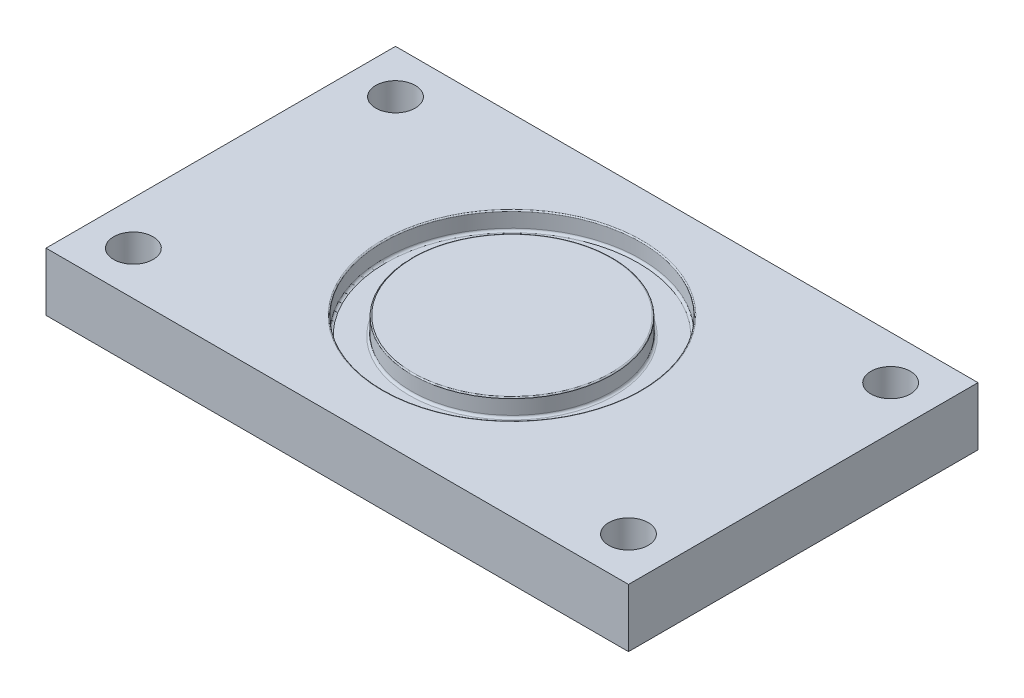
ISO-10303-21;
HEADER;
FILE_DESCRIPTION(('STEP AP214'),'2;1');
FILE_NAME('part.step','',(''),(''),'','','');
FILE_SCHEMA(('AUTOMOTIVE_DESIGN { 1 0 10303 214 1 1 1 1 }'));
ENDSEC;
DATA;
#1=APPLICATION_CONTEXT('core data for automotive mechanical design processes');
#2=APPLICATION_PROTOCOL_DEFINITION('international standard','automotive_design',2000,#1);
#3=PRODUCT_CONTEXT('',#1,'mechanical');
#4=PRODUCT('Part','Part','',(#3));
#5=PRODUCT_RELATED_PRODUCT_CATEGORY('part','',(#4));
#6=PRODUCT_DEFINITION_FORMATION('','',#4);
#7=PRODUCT_DEFINITION_CONTEXT('part definition',#1,'design');
#8=PRODUCT_DEFINITION('design','',#6,#7);
#9=PRODUCT_DEFINITION_SHAPE('','',#8);
#10=(LENGTH_UNIT() NAMED_UNIT(*) SI_UNIT(.MILLI.,.METRE.));
#11=(NAMED_UNIT(*) PLANE_ANGLE_UNIT() SI_UNIT($,.RADIAN.));
#12=(NAMED_UNIT(*) SI_UNIT($,.STERADIAN.) SOLID_ANGLE_UNIT());
#13=UNCERTAINTY_MEASURE_WITH_UNIT(LENGTH_MEASURE(1.E-05),#10,'distance_accuracy_value','');
#14=(GEOMETRIC_REPRESENTATION_CONTEXT(3) GLOBAL_UNCERTAINTY_ASSIGNED_CONTEXT((#13)) GLOBAL_UNIT_ASSIGNED_CONTEXT((#10,
#11,#12)) REPRESENTATION_CONTEXT('',''));
#15=CARTESIAN_POINT('',(0.,0.,0.));
#16=DIRECTION('',(0.,0.,1.));
#17=DIRECTION('',(1.,0.,0.));
#18=AXIS2_PLACEMENT_3D('',#15,#16,#17);
#19=CARTESIAN_POINT('',(-31.75,6.35,19.05));
#20=DIRECTION('',(1.,0.,0.));
#21=DIRECTION('',(0.,0.,-1.));
#22=AXIS2_PLACEMENT_3D('',#19,#20,#21);
#23=PLANE('',#22);
#24=DIRECTION('',(0.,0.,1.));
#25=VECTOR('',#24,1.);
#26=CARTESIAN_POINT('',(-31.75,0.,19.05));
#27=LINE('',#26,#25);
#28=CARTESIAN_POINT('',(-31.75,0.,-19.05));
#29=VERTEX_POINT('',#28);
#30=CARTESIAN_POINT('',(-31.75,0.,19.05));
#31=VERTEX_POINT('',#30);
#32=EDGE_CURVE('E104',#29,#31,#27,.T.);
#33=ORIENTED_EDGE('',*,*,#32,.T.);
#34=DIRECTION('',(0.,-1.,0.));
#35=VECTOR('',#34,1.);
#36=CARTESIAN_POINT('',(-31.75,6.35,19.05));
#37=LINE('',#36,#35);
#38=CARTESIAN_POINT('',(-31.75,6.35,19.05));
#39=VERTEX_POINT('',#38);
#40=EDGE_CURVE('E95',#39,#31,#37,.T.);
#41=ORIENTED_EDGE('',*,*,#40,.F.);
#42=DIRECTION('',(0.,0.,1.));
#43=VECTOR('',#42,1.);
#44=CARTESIAN_POINT('',(-31.75,6.35,19.05));
#45=LINE('',#44,#43);
#46=CARTESIAN_POINT('',(-31.75,6.35,-19.05));
#47=VERTEX_POINT('',#46);
#48=EDGE_CURVE('E89',#47,#39,#45,.T.);
#49=ORIENTED_EDGE('',*,*,#48,.F.);
#50=DIRECTION('',(0.,-1.,0.));
#51=VECTOR('',#50,1.);
#52=CARTESIAN_POINT('',(-31.75,6.35,-19.05));
#53=LINE('',#52,#51);
#54=EDGE_CURVE('E100',#47,#29,#53,.T.);
#55=ORIENTED_EDGE('',*,*,#54,.T.);
#56=EDGE_LOOP('',(#33,#41,#49,#55));
#57=FACE_BOUND('',#56,.T.);
#58=ADVANCED_FACE('F36',(#57),#23,.F.);
#59=CARTESIAN_POINT('',(31.75,6.35,19.05));
#60=DIRECTION('',(0.,0.,-1.));
#61=DIRECTION('',(-1.,0.,0.));
#62=AXIS2_PLACEMENT_3D('',#59,#60,#61);
#63=PLANE('',#62);
#64=DIRECTION('',(1.,0.,0.));
#65=VECTOR('',#64,1.);
#66=CARTESIAN_POINT('',(31.75,0.,19.05));
#67=LINE('',#66,#65);
#68=CARTESIAN_POINT('',(31.75,0.,19.05));
#69=VERTEX_POINT('',#68);
#70=EDGE_CURVE('E94',#31,#69,#67,.T.);
#71=ORIENTED_EDGE('',*,*,#70,.T.);
#72=DIRECTION('',(0.,-1.,0.));
#73=VECTOR('',#72,1.);
#74=CARTESIAN_POINT('',(31.75,6.35,19.05));
#75=LINE('',#74,#73);
#76=CARTESIAN_POINT('',(31.75,6.35,19.05));
#77=VERTEX_POINT('',#76);
#78=EDGE_CURVE('E92',#77,#69,#75,.T.);
#79=ORIENTED_EDGE('',*,*,#78,.F.);
#80=DIRECTION('',(1.,0.,0.));
#81=VECTOR('',#80,1.);
#82=CARTESIAN_POINT('',(31.75,6.35,19.05));
#83=LINE('',#82,#81);
#84=EDGE_CURVE('E84',#39,#77,#83,.T.);
#85=ORIENTED_EDGE('',*,*,#84,.F.);
#86=ORIENTED_EDGE('',*,*,#40,.T.);
#87=EDGE_LOOP('',(#71,#79,#85,#86));
#88=FACE_BOUND('',#87,.T.);
#89=ADVANCED_FACE('F93',(#88),#63,.F.);
#90=CARTESIAN_POINT('',(31.75,6.35,19.05));
#91=DIRECTION('',(-1.,0.,0.));
#92=DIRECTION('',(0.,0.,1.));
#93=AXIS2_PLACEMENT_3D('',#90,#91,#92);
#94=PLANE('',#93);
#95=DIRECTION('',(0.,0.,-1.));
#96=VECTOR('',#95,1.);
#97=CARTESIAN_POINT('',(31.75,0.,19.05));
#98=LINE('',#97,#96);
#99=CARTESIAN_POINT('',(31.75,0.,-19.05));
#100=VERTEX_POINT('',#99);
#101=EDGE_CURVE('E70',#69,#100,#98,.T.);
#102=ORIENTED_EDGE('',*,*,#101,.T.);
#103=DIRECTION('',(0.,-1.,0.));
#104=VECTOR('',#103,1.);
#105=CARTESIAN_POINT('',(31.75,6.35,-19.05));
#106=LINE('',#105,#104);
#107=CARTESIAN_POINT('',(31.75,6.35,-19.05));
#108=VERTEX_POINT('',#107);
#109=EDGE_CURVE('E96',#108,#100,#106,.T.);
#110=ORIENTED_EDGE('',*,*,#109,.F.);
#111=DIRECTION('',(0.,0.,-1.));
#112=VECTOR('',#111,1.);
#113=CARTESIAN_POINT('',(31.75,6.35,19.05));
#114=LINE('',#113,#112);
#115=EDGE_CURVE('E87',#77,#108,#114,.T.);
#116=ORIENTED_EDGE('',*,*,#115,.F.);
#117=ORIENTED_EDGE('',*,*,#78,.T.);
#118=EDGE_LOOP('',(#102,#110,#116,#117));
#119=FACE_BOUND('',#118,.T.);
#120=ADVANCED_FACE('F98',(#119),#94,.F.);
#121=CARTESIAN_POINT('',(31.75,6.35,-19.05));
#122=DIRECTION('',(0.,0.,1.));
#123=DIRECTION('',(1.,0.,0.));
#124=AXIS2_PLACEMENT_3D('',#121,#122,#123);
#125=PLANE('',#124);
#126=DIRECTION('',(-1.,0.,0.));
#127=VECTOR('',#126,1.);
#128=CARTESIAN_POINT('',(31.75,0.,-19.05));
#129=LINE('',#128,#127);
#130=EDGE_CURVE('E76',#100,#29,#129,.T.);
#131=ORIENTED_EDGE('',*,*,#130,.T.);
#132=ORIENTED_EDGE('',*,*,#54,.F.);
#133=DIRECTION('',(-1.,0.,0.));
#134=VECTOR('',#133,1.);
#135=CARTESIAN_POINT('',(31.75,6.35,-19.05));
#136=LINE('',#135,#134);
#137=EDGE_CURVE('E53',#108,#47,#136,.T.);
#138=ORIENTED_EDGE('',*,*,#137,.F.);
#139=ORIENTED_EDGE('',*,*,#109,.T.);
#140=EDGE_LOOP('',(#131,#132,#138,#139));
#141=FACE_BOUND('',#140,.T.);
#142=ADVANCED_FACE('F170',(#141),#125,.F.);
#143=CARTESIAN_POINT('',(0.,6.35,0.));
#144=DIRECTION('',(0.,1.,0.));
#145=DIRECTION('',(0.,0.,1.));
#146=AXIS2_PLACEMENT_3D('',#143,#144,#145);
#147=PLANE('',#146);
#148=CARTESIAN_POINT('',(0.,6.35,0.));
#149=DIRECTION('',(0.,1.,0.));
#150=DIRECTION('',(0.,0.,1.));
#151=AXIS2_PLACEMENT_3D('',#148,#149,#150);
#152=CIRCLE('',#151,14.1732);
#153=CARTESIAN_POINT('',(0.,6.35,14.1732));
#154=VERTEX_POINT('',#153);
#155=EDGE_CURVE('E123',#154,#154,#152,.F.);
#156=ORIENTED_EDGE('',*,*,#155,.T.);
#157=EDGE_LOOP('',(#156));
#158=FACE_BOUND('',#157,.T.);
#159=CARTESIAN_POINT('',(-26.9875,6.35,14.2875));
#160=DIRECTION('',(0.,-1.,0.));
#161=DIRECTION('',(0.,0.,-1.));
#162=AXIS2_PLACEMENT_3D('',#159,#160,#161);
#163=CIRCLE('',#162,2.15265);
#164=CARTESIAN_POINT('',(-26.9875,6.35,12.13485));
#165=VERTEX_POINT('',#164);
#166=EDGE_CURVE('E213',#165,#165,#163,.T.);
#167=ORIENTED_EDGE('',*,*,#166,.T.);
#168=EDGE_LOOP('',(#167));
#169=FACE_BOUND('',#168,.T.);
#170=CARTESIAN_POINT('',(26.9875,6.35,14.2875000000004));
#171=DIRECTION('',(0.,-1.,0.));
#172=DIRECTION('',(0.,0.,-1.));
#173=AXIS2_PLACEMENT_3D('',#170,#171,#172);
#174=CIRCLE('',#173,2.15265);
#175=CARTESIAN_POINT('',(26.9875,6.35,12.1348500000004));
#176=VERTEX_POINT('',#175);
#177=EDGE_CURVE('E223',#176,#176,#174,.T.);
#178=ORIENTED_EDGE('',*,*,#177,.T.);
#179=EDGE_LOOP('',(#178));
#180=FACE_BOUND('',#179,.T.);
#181=CARTESIAN_POINT('',(26.9875000000001,6.35,-14.2874999999996));
#182=DIRECTION('',(0.,-1.,0.));
#183=DIRECTION('',(0.,0.,-1.));
#184=AXIS2_PLACEMENT_3D('',#181,#182,#183);
#185=CIRCLE('',#184,2.15265);
#186=CARTESIAN_POINT('',(26.9875000000001,6.35,-16.4401499999996));
#187=VERTEX_POINT('',#186);
#188=EDGE_CURVE('E229',#187,#187,#185,.T.);
#189=ORIENTED_EDGE('',*,*,#188,.T.);
#190=EDGE_LOOP('',(#189));
#191=FACE_BOUND('',#190,.T.);
#192=CARTESIAN_POINT('',(-26.9874999999999,6.35,-14.2875));
#193=DIRECTION('',(0.,-1.,0.));
#194=DIRECTION('',(0.,0.,-1.));
#195=AXIS2_PLACEMENT_3D('',#192,#193,#194);
#196=CIRCLE('',#195,2.15265);
#197=CARTESIAN_POINT('',(-26.9874999999999,6.35,-16.44015));
#198=VERTEX_POINT('',#197);
#199=EDGE_CURVE('E107',#198,#198,#196,.T.);
#200=ORIENTED_EDGE('',*,*,#199,.T.);
#201=EDGE_LOOP('',(#200));
#202=FACE_BOUND('',#201,.T.);
#203=ORIENTED_EDGE('',*,*,#48,.T.);
#204=ORIENTED_EDGE('',*,*,#84,.T.);
#205=ORIENTED_EDGE('',*,*,#115,.T.);
#206=ORIENTED_EDGE('',*,*,#137,.T.);
#207=EDGE_LOOP('',(#203,#204,#205,#206));
#208=FACE_BOUND('',#207,.T.);
#209=ADVANCED_FACE('F85',(#158,#169,#180,#191,#202,#208),#147,.T.);
#210=CARTESIAN_POINT('',(0.,0.,0.));
#211=DIRECTION('',(0.,1.,0.));
#212=DIRECTION('',(0.,0.,1.));
#213=AXIS2_PLACEMENT_3D('',#210,#211,#212);
#214=PLANE('',#213);
#215=CARTESIAN_POINT('',(-26.9875,0.,14.2875));
#216=DIRECTION('',(0.,-1.,0.));
#217=DIRECTION('',(0.,0.,-1.));
#218=AXIS2_PLACEMENT_3D('',#215,#216,#217);
#219=CIRCLE('',#218,2.15265);
#220=CARTESIAN_POINT('',(-26.9875,0.,12.13485));
#221=VERTEX_POINT('',#220);
#222=EDGE_CURVE('E216',#221,#221,#219,.T.);
#223=ORIENTED_EDGE('',*,*,#222,.F.);
#224=EDGE_LOOP('',(#223));
#225=FACE_BOUND('',#224,.T.);
#226=CARTESIAN_POINT('',(26.9875,0.,14.2875000000004));
#227=DIRECTION('',(0.,-1.,0.));
#228=DIRECTION('',(0.,0.,-1.));
#229=AXIS2_PLACEMENT_3D('',#226,#227,#228);
#230=CIRCLE('',#229,2.15265);
#231=CARTESIAN_POINT('',(26.9875,0.,12.1348500000004));
#232=VERTEX_POINT('',#231);
#233=EDGE_CURVE('E218',#232,#232,#230,.T.);
#234=ORIENTED_EDGE('',*,*,#233,.F.);
#235=EDGE_LOOP('',(#234));
#236=FACE_BOUND('',#235,.T.);
#237=CARTESIAN_POINT('',(26.9875000000001,0.,-14.2874999999996));
#238=DIRECTION('',(0.,-1.,0.));
#239=DIRECTION('',(0.,0.,-1.));
#240=AXIS2_PLACEMENT_3D('',#237,#238,#239);
#241=CIRCLE('',#240,2.15265);
#242=CARTESIAN_POINT('',(26.9875000000001,0.,-16.4401499999996));
#243=VERTEX_POINT('',#242);
#244=EDGE_CURVE('E226',#243,#243,#241,.T.);
#245=ORIENTED_EDGE('',*,*,#244,.F.);
#246=EDGE_LOOP('',(#245));
#247=FACE_BOUND('',#246,.T.);
#248=CARTESIAN_POINT('',(-26.9874999999999,0.,-14.2875));
#249=DIRECTION('',(0.,-1.,0.));
#250=DIRECTION('',(0.,0.,-1.));
#251=AXIS2_PLACEMENT_3D('',#248,#249,#250);
#252=CIRCLE('',#251,2.15265);
#253=CARTESIAN_POINT('',(-26.9874999999999,0.,-16.44015));
#254=VERTEX_POINT('',#253);
#255=EDGE_CURVE('E232',#254,#254,#252,.T.);
#256=ORIENTED_EDGE('',*,*,#255,.F.);
#257=EDGE_LOOP('',(#256));
#258=FACE_BOUND('',#257,.T.);
#259=ORIENTED_EDGE('',*,*,#32,.F.);
#260=ORIENTED_EDGE('',*,*,#130,.F.);
#261=ORIENTED_EDGE('',*,*,#101,.F.);
#262=ORIENTED_EDGE('',*,*,#70,.F.);
#263=EDGE_LOOP('',(#259,#260,#261,#262));
#264=FACE_BOUND('',#263,.T.);
#265=ADVANCED_FACE('F169',(#225,#236,#247,#258,#264),#214,.F.);
#266=CARTESIAN_POINT('',(0.,4.3942,0.));
#267=DIRECTION('',(0.,1.,0.));
#268=DIRECTION('',(0.,0.,1.));
#269=AXIS2_PLACEMENT_3D('',#266,#267,#268);
#270=CYLINDRICAL_SURFACE('',#269,14.0462);
#271=CARTESIAN_POINT('',(0.,4.6482,0.));
#272=DIRECTION('',(0.,1.,0.));
#273=DIRECTION('',(0.,0.,1.));
#274=AXIS2_PLACEMENT_3D('',#271,#272,#273);
#275=CIRCLE('',#274,14.0462);
#276=CARTESIAN_POINT('',(0.,4.6482,14.0462));
#277=VERTEX_POINT('',#276);
#278=EDGE_CURVE('E11',#277,#277,#275,.F.);
#279=ORIENTED_EDGE('',*,*,#278,.T.);
#280=EDGE_LOOP('',(#279));
#281=FACE_BOUND('',#280,.T.);
#282=CARTESIAN_POINT('',(0.,6.223,0.));
#283=DIRECTION('',(0.,1.,0.));
#284=DIRECTION('',(0.,0.,1.));
#285=AXIS2_PLACEMENT_3D('',#282,#283,#284);
#286=CIRCLE('',#285,14.0462);
#287=CARTESIAN_POINT('',(0.,6.223,14.0462));
#288=VERTEX_POINT('',#287);
#289=EDGE_CURVE('E120',#288,#288,#286,.T.);
#290=ORIENTED_EDGE('',*,*,#289,.T.);
#291=EDGE_LOOP('',(#290));
#292=FACE_BOUND('',#291,.T.);
#293=ADVANCED_FACE('F189',(#281,#292),#270,.F.);
#294=CARTESIAN_POINT('',(0.,4.3942,0.));
#295=DIRECTION('',(0.,1.,0.));
#296=DIRECTION('',(0.,0.,1.));
#297=AXIS2_PLACEMENT_3D('',#294,#295,#296);
#298=PLANE('',#297);
#299=CARTESIAN_POINT('',(0.,4.3942,0.));
#300=DIRECTION('',(0.,1.,0.));
#301=DIRECTION('',(0.,0.,1.));
#302=AXIS2_PLACEMENT_3D('',#299,#300,#301);
#303=CIRCLE('',#302,11.2014);
#304=CARTESIAN_POINT('',(0.,4.3942,11.2014));
#305=VERTEX_POINT('',#304);
#306=EDGE_CURVE('E45',#305,#305,#303,.F.);
#307=ORIENTED_EDGE('',*,*,#306,.T.);
#308=EDGE_LOOP('',(#307));
#309=FACE_BOUND('',#308,.T.);
#310=CARTESIAN_POINT('',(0.,4.3942,0.));
#311=DIRECTION('',(0.,1.,0.));
#312=DIRECTION('',(0.,0.,1.));
#313=AXIS2_PLACEMENT_3D('',#310,#311,#312);
#314=CIRCLE('',#313,13.7922);
#315=CARTESIAN_POINT('',(0.,4.3942,13.7922));
#316=VERTEX_POINT('',#315);
#317=EDGE_CURVE('E129',#316,#316,#314,.T.);
#318=ORIENTED_EDGE('',*,*,#317,.T.);
#319=EDGE_LOOP('',(#318));
#320=FACE_BOUND('',#319,.T.);
#321=ADVANCED_FACE('F134',(#309,#320),#298,.T.);
#322=CARTESIAN_POINT('',(0.,4.3942,0.));
#323=DIRECTION('',(0.,1.,0.));
#324=DIRECTION('',(0.,0.,1.));
#325=AXIS2_PLACEMENT_3D('',#322,#323,#324);
#326=CYLINDRICAL_SURFACE('',#325,10.9474);
#327=CARTESIAN_POINT('',(0.,4.6482,0.));
#328=DIRECTION('',(0.,1.,0.));
#329=DIRECTION('',(0.,0.,1.));
#330=AXIS2_PLACEMENT_3D('',#327,#328,#329);
#331=CIRCLE('',#330,10.9474);
#332=CARTESIAN_POINT('',(0.,4.6482,10.9474));
#333=VERTEX_POINT('',#332);
#334=EDGE_CURVE('E126',#333,#333,#331,.T.);
#335=ORIENTED_EDGE('',*,*,#334,.T.);
#336=EDGE_LOOP('',(#335));
#337=FACE_BOUND('',#336,.T.);
#338=CARTESIAN_POINT('',(0.,6.223,0.));
#339=DIRECTION('',(0.,1.,0.));
#340=DIRECTION('',(0.,0.,1.));
#341=AXIS2_PLACEMENT_3D('',#338,#339,#340);
#342=CIRCLE('',#341,10.9474);
#343=CARTESIAN_POINT('',(0.,6.223,10.9474));
#344=VERTEX_POINT('',#343);
#345=EDGE_CURVE('E117',#344,#344,#342,.F.);
#346=ORIENTED_EDGE('',*,*,#345,.T.);
#347=EDGE_LOOP('',(#346));
#348=FACE_BOUND('',#347,.T.);
#349=ADVANCED_FACE('F143',(#337,#348),#326,.T.);
#350=CARTESIAN_POINT('',(0.,6.35,0.));
#351=DIRECTION('',(0.,1.,0.));
#352=DIRECTION('',(0.,0.,1.));
#353=AXIS2_PLACEMENT_3D('',#350,#351,#352);
#354=CIRCLE('',#353,10.8204);
#355=CARTESIAN_POINT('',(0.,6.35,10.8204));
#356=VERTEX_POINT('',#355);
#357=EDGE_CURVE('E114',#356,#356,#354,.T.);
#358=ORIENTED_EDGE('',*,*,#357,.T.);
#359=EDGE_LOOP('',(#358));
#360=FACE_BOUND('',#359,.T.);
#361=ADVANCED_FACE('F146',(#360),#147,.T.);
#362=CARTESIAN_POINT('',(-26.9874999999999,0.,-14.2875));
#363=DIRECTION('',(0.,-1.,0.));
#364=DIRECTION('',(0.,0.,-1.));
#365=AXIS2_PLACEMENT_3D('',#362,#363,#364);
#366=CYLINDRICAL_SURFACE('',#365,2.15265);
#367=ORIENTED_EDGE('',*,*,#199,.F.);
#368=EDGE_LOOP('',(#367));
#369=FACE_BOUND('',#368,.T.);
#370=ORIENTED_EDGE('',*,*,#255,.T.);
#371=EDGE_LOOP('',(#370));
#372=FACE_BOUND('',#371,.T.);
#373=ADVANCED_FACE('F158',(#369,#372),#366,.F.);
#374=CARTESIAN_POINT('',(26.9875000000001,0.,-14.2874999999996));
#375=DIRECTION('',(0.,-1.,0.));
#376=DIRECTION('',(0.,0.,-1.));
#377=AXIS2_PLACEMENT_3D('',#374,#375,#376);
#378=CYLINDRICAL_SURFACE('',#377,2.15265);
#379=ORIENTED_EDGE('',*,*,#188,.F.);
#380=EDGE_LOOP('',(#379));
#381=FACE_BOUND('',#380,.T.);
#382=ORIENTED_EDGE('',*,*,#244,.T.);
#383=EDGE_LOOP('',(#382));
#384=FACE_BOUND('',#383,.T.);
#385=ADVANCED_FACE('F163',(#381,#384),#378,.F.);
#386=CARTESIAN_POINT('',(26.9875,0.,14.2875000000004));
#387=DIRECTION('',(0.,-1.,0.));
#388=DIRECTION('',(0.,0.,-1.));
#389=AXIS2_PLACEMENT_3D('',#386,#387,#388);
#390=CYLINDRICAL_SURFACE('',#389,2.15265);
#391=ORIENTED_EDGE('',*,*,#177,.F.);
#392=EDGE_LOOP('',(#391));
#393=FACE_BOUND('',#392,.T.);
#394=ORIENTED_EDGE('',*,*,#233,.T.);
#395=EDGE_LOOP('',(#394));
#396=FACE_BOUND('',#395,.T.);
#397=ADVANCED_FACE('F201',(#393,#396),#390,.F.);
#398=CARTESIAN_POINT('',(-26.9875,0.,14.2875));
#399=DIRECTION('',(0.,-1.,0.));
#400=DIRECTION('',(0.,0.,-1.));
#401=AXIS2_PLACEMENT_3D('',#398,#399,#400);
#402=CYLINDRICAL_SURFACE('',#401,2.15265);
#403=ORIENTED_EDGE('',*,*,#166,.F.);
#404=EDGE_LOOP('',(#403));
#405=FACE_BOUND('',#404,.T.);
#406=ORIENTED_EDGE('',*,*,#222,.T.);
#407=EDGE_LOOP('',(#406));
#408=FACE_BOUND('',#407,.T.);
#409=ADVANCED_FACE('F153',(#405,#408),#402,.F.);
#410=CARTESIAN_POINT('',(0.,6.223,0.));
#411=DIRECTION('',(0.,1.,0.));
#412=DIRECTION('',(0.,0.,1.));
#413=AXIS2_PLACEMENT_3D('',#410,#411,#412);
#414=TOROIDAL_SURFACE('',#413,10.8204,0.127);
#415=ORIENTED_EDGE('',*,*,#345,.F.);
#416=EDGE_LOOP('',(#415));
#417=FACE_BOUND('',#416,.T.);
#418=ORIENTED_EDGE('',*,*,#357,.F.);
#419=EDGE_LOOP('',(#418));
#420=FACE_BOUND('',#419,.T.);
#421=ADVANCED_FACE('F150',(#417,#420),#414,.T.);
#422=CARTESIAN_POINT('',(0.,6.223,0.));
#423=DIRECTION('',(0.,1.,0.));
#424=DIRECTION('',(0.,0.,1.));
#425=AXIS2_PLACEMENT_3D('',#422,#423,#424);
#426=TOROIDAL_SURFACE('',#425,14.1732,0.127);
#427=ORIENTED_EDGE('',*,*,#155,.F.);
#428=EDGE_LOOP('',(#427));
#429=FACE_BOUND('',#428,.T.);
#430=ORIENTED_EDGE('',*,*,#289,.F.);
#431=EDGE_LOOP('',(#430));
#432=FACE_BOUND('',#431,.T.);
#433=ADVANCED_FACE('F140',(#429,#432),#426,.T.);
#434=CARTESIAN_POINT('',(0.,4.6482,0.));
#435=DIRECTION('',(0.,1.,0.));
#436=DIRECTION('',(0.,0.,1.));
#437=AXIS2_PLACEMENT_3D('',#434,#435,#436);
#438=TOROIDAL_SURFACE('',#437,11.2014,0.254);
#439=ORIENTED_EDGE('',*,*,#306,.F.);
#440=EDGE_LOOP('',(#439));
#441=FACE_BOUND('',#440,.T.);
#442=ORIENTED_EDGE('',*,*,#334,.F.);
#443=EDGE_LOOP('',(#442));
#444=FACE_BOUND('',#443,.T.);
#445=ADVANCED_FACE('F137',(#441,#444),#438,.F.);
#446=CARTESIAN_POINT('',(0.,4.6482,0.));
#447=DIRECTION('',(0.,1.,0.));
#448=DIRECTION('',(0.,0.,1.));
#449=AXIS2_PLACEMENT_3D('',#446,#447,#448);
#450=TOROIDAL_SURFACE('',#449,13.7922,0.254);
#451=ORIENTED_EDGE('',*,*,#278,.F.);
#452=EDGE_LOOP('',(#451));
#453=FACE_BOUND('',#452,.T.);
#454=ORIENTED_EDGE('',*,*,#317,.F.);
#455=EDGE_LOOP('',(#454));
#456=FACE_BOUND('',#455,.T.);
#457=ADVANCED_FACE('F38',(#453,#456),#450,.F.);
#458=CLOSED_SHELL('',(#58,#89,#120,#142,#209,#265,#293,#321,#349,#361,#373,#385,#397,#409,#421,
#433,#445,#457));
#459=MANIFOLD_SOLID_BREP('B2',#458);
#460=ADVANCED_BREP_SHAPE_REPRESENTATION('',(#18,#459),#14);
#461=SHAPE_DEFINITION_REPRESENTATION(#9,#460);
ENDSEC;
END-ISO-10303-21;
